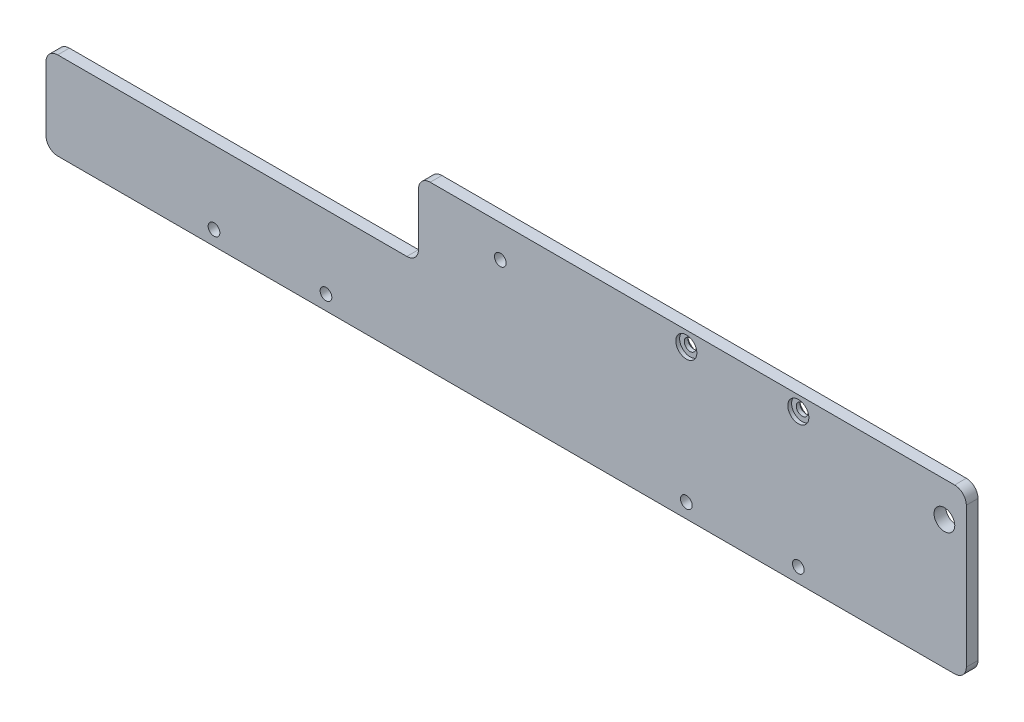
ISO-10303-21;
HEADER;
FILE_DESCRIPTION(('STEP AP214'),'2;1');
FILE_NAME('part.step','',(''),(''),'','','');
FILE_SCHEMA(('AUTOMOTIVE_DESIGN { 1 0 10303 214 1 1 1 1 }'));
ENDSEC;
DATA;
#1=APPLICATION_CONTEXT('core data for automotive mechanical design processes');
#2=APPLICATION_PROTOCOL_DEFINITION('international standard','automotive_design',2000,#1);
#3=PRODUCT_CONTEXT('',#1,'mechanical');
#4=PRODUCT('Part','Part','',(#3));
#5=PRODUCT_RELATED_PRODUCT_CATEGORY('part','',(#4));
#6=PRODUCT_DEFINITION_FORMATION('','',#4);
#7=PRODUCT_DEFINITION_CONTEXT('part definition',#1,'design');
#8=PRODUCT_DEFINITION('design','',#6,#7);
#9=PRODUCT_DEFINITION_SHAPE('','',#8);
#10=(LENGTH_UNIT() NAMED_UNIT(*) SI_UNIT(.MILLI.,.METRE.));
#11=(NAMED_UNIT(*) PLANE_ANGLE_UNIT() SI_UNIT($,.RADIAN.));
#12=(NAMED_UNIT(*) SI_UNIT($,.STERADIAN.) SOLID_ANGLE_UNIT());
#13=UNCERTAINTY_MEASURE_WITH_UNIT(LENGTH_MEASURE(1.E-05),#10,'distance_accuracy_value','');
#14=(GEOMETRIC_REPRESENTATION_CONTEXT(3) GLOBAL_UNCERTAINTY_ASSIGNED_CONTEXT((#13)) GLOBAL_UNIT_ASSIGNED_CONTEXT((#10,
#11,#12)) REPRESENTATION_CONTEXT('',''));
#15=CARTESIAN_POINT('',(0.,0.,0.));
#16=DIRECTION('',(0.,0.,1.));
#17=DIRECTION('',(1.,0.,0.));
#18=AXIS2_PLACEMENT_3D('',#15,#16,#17);
#19=CARTESIAN_POINT('',(34.4759372454945,38.5899107385244,4.));
#20=DIRECTION('',(0.,0.,-1.));
#21=DIRECTION('',(-1.,0.,0.));
#22=AXIS2_PLACEMENT_3D('',#19,#20,#21);
#23=CYLINDRICAL_SURFACE('',#22,1.99999999999999);
#24=CARTESIAN_POINT('',(34.4759372454945,38.5899107385244,1.4));
#25=DIRECTION('',(0.,0.,-1.));
#26=DIRECTION('',(-1.,0.,0.));
#27=AXIS2_PLACEMENT_3D('',#24,#25,#26);
#28=CIRCLE('',#27,1.99999999999999);
#29=CARTESIAN_POINT('',(32.4759372454945,38.5899107385244,1.4));
#30=VERTEX_POINT('',#29);
#31=EDGE_CURVE('E213',#30,#30,#28,.T.);
#32=ORIENTED_EDGE('',*,*,#31,.T.);
#33=EDGE_LOOP('',(#32));
#34=FACE_BOUND('',#33,.T.);
#35=CARTESIAN_POINT('',(34.4759372454945,38.5899107385244,2.7));
#36=DIRECTION('',(0.,0.,1.));
#37=DIRECTION('',(1.,0.,0.));
#38=AXIS2_PLACEMENT_3D('',#35,#36,#37);
#39=CIRCLE('',#38,1.99999999999999);
#40=CARTESIAN_POINT('',(36.4759372454945,38.5899107385244,2.7));
#41=VERTEX_POINT('',#40);
#42=EDGE_CURVE('E41',#41,#41,#39,.T.);
#43=ORIENTED_EDGE('',*,*,#42,.T.);
#44=EDGE_LOOP('',(#43));
#45=FACE_BOUND('',#44,.T.);
#46=ADVANCED_FACE('F37',(#34,#45),#23,.F.);
#47=CARTESIAN_POINT('',(72.8059372454945,38.5899107385243,4.));
#48=DIRECTION('',(0.,0.,-1.));
#49=DIRECTION('',(-1.,0.,0.));
#50=AXIS2_PLACEMENT_3D('',#47,#48,#49);
#51=CYLINDRICAL_SURFACE('',#50,2.);
#52=CARTESIAN_POINT('',(72.8059372454945,38.5899107385243,1.4));
#53=DIRECTION('',(0.,0.,-1.));
#54=DIRECTION('',(-1.,0.,0.));
#55=AXIS2_PLACEMENT_3D('',#52,#53,#54);
#56=CIRCLE('',#55,2.);
#57=CARTESIAN_POINT('',(70.8059372454945,38.5899107385243,1.4));
#58=VERTEX_POINT('',#57);
#59=EDGE_CURVE('E210',#58,#58,#56,.T.);
#60=ORIENTED_EDGE('',*,*,#59,.T.);
#61=EDGE_LOOP('',(#60));
#62=FACE_BOUND('',#61,.T.);
#63=CARTESIAN_POINT('',(72.8059372454945,38.5899107385243,2.7));
#64=DIRECTION('',(0.,0.,1.));
#65=DIRECTION('',(1.,0.,0.));
#66=AXIS2_PLACEMENT_3D('',#63,#64,#65);
#67=CIRCLE('',#66,2.);
#68=CARTESIAN_POINT('',(74.8059372454945,38.5899107385243,2.7));
#69=VERTEX_POINT('',#68);
#70=EDGE_CURVE('E217',#69,#69,#67,.T.);
#71=ORIENTED_EDGE('',*,*,#70,.T.);
#72=EDGE_LOOP('',(#71));
#73=FACE_BOUND('',#72,.T.);
#74=ADVANCED_FACE('F341',(#62,#73),#51,.F.);
#75=CARTESIAN_POINT('',(0.,17.5899107385243,4.));
#76=DIRECTION('',(0.,-1.,0.));
#77=DIRECTION('',(1.,0.,0.));
#78=AXIS2_PLACEMENT_3D('',#75,#76,#77);
#79=PLANE('',#78);
#80=DIRECTION('',(0.,0.,-1.));
#81=VECTOR('',#80,1.);
#82=CARTESIAN_POINT('',(-61.1940627545055,17.5899107385243,4.));
#83=LINE('',#82,#81);
#84=CARTESIAN_POINT('',(-61.1940627545055,17.5899107385243,4.));
#85=VERTEX_POINT('',#84);
#86=CARTESIAN_POINT('',(-61.1940627545055,17.5899107385243,0.));
#87=VERTEX_POINT('',#86);
#88=EDGE_CURVE('E264',#85,#87,#83,.T.);
#89=ORIENTED_EDGE('',*,*,#88,.T.);
#90=DIRECTION('',(-1.,0.,0.));
#91=VECTOR('',#90,1.);
#92=CARTESIAN_POINT('',(0.,17.5899107385243,0.));
#93=LINE('',#92,#91);
#94=CARTESIAN_POINT('',(-180.694062754505,17.5899107385243,0.));
#95=VERTEX_POINT('',#94);
#96=EDGE_CURVE('E164',#87,#95,#93,.T.);
#97=ORIENTED_EDGE('',*,*,#96,.T.);
#98=DIRECTION('',(0.,0.,-1.));
#99=VECTOR('',#98,1.);
#100=CARTESIAN_POINT('',(-180.694062754505,17.5899107385243,4.));
#101=LINE('',#100,#99);
#102=CARTESIAN_POINT('',(-180.694062754505,17.5899107385243,4.));
#103=VERTEX_POINT('',#102);
#104=EDGE_CURVE('E11',#103,#95,#101,.T.);
#105=ORIENTED_EDGE('',*,*,#104,.F.);
#106=DIRECTION('',(-1.,0.,0.));
#107=VECTOR('',#106,1.);
#108=CARTESIAN_POINT('',(0.,17.5899107385243,4.));
#109=LINE('',#108,#107);
#110=EDGE_CURVE('E54',#85,#103,#109,.T.);
#111=ORIENTED_EDGE('',*,*,#110,.F.);
#112=EDGE_LOOP('',(#89,#97,#105,#111));
#113=FACE_BOUND('',#112,.T.);
#114=ADVANCED_FACE('F39',(#113),#79,.F.);
#115=CARTESIAN_POINT('',(-180.694062754505,13.5899107385243,4.));
#116=DIRECTION('',(0.,0.,-1.));
#117=DIRECTION('',(-1.,0.,0.));
#118=AXIS2_PLACEMENT_3D('',#115,#116,#117);
#119=CYLINDRICAL_SURFACE('',#118,4.);
#120=CARTESIAN_POINT('',(-180.694062754505,13.5899107385243,0.));
#121=DIRECTION('',(0.,0.,1.));
#122=DIRECTION('',(1.,0.,0.));
#123=AXIS2_PLACEMENT_3D('',#120,#121,#122);
#124=CIRCLE('',#123,4.);
#125=CARTESIAN_POINT('',(-184.694062754505,13.5899107385243,0.));
#126=VERTEX_POINT('',#125);
#127=EDGE_CURVE('E166',#126,#95,#124,.F.);
#128=ORIENTED_EDGE('',*,*,#127,.F.);
#129=DIRECTION('',(0.,0.,-1.));
#130=VECTOR('',#129,1.);
#131=CARTESIAN_POINT('',(-184.694062754505,13.5899107385243,4.));
#132=LINE('',#131,#130);
#133=CARTESIAN_POINT('',(-184.694062754505,13.5899107385243,4.));
#134=VERTEX_POINT('',#133);
#135=EDGE_CURVE('E46',#134,#126,#132,.T.);
#136=ORIENTED_EDGE('',*,*,#135,.F.);
#137=CARTESIAN_POINT('',(-180.694062754505,13.5899107385243,4.));
#138=DIRECTION('',(0.,0.,1.));
#139=DIRECTION('',(1.,0.,0.));
#140=AXIS2_PLACEMENT_3D('',#137,#138,#139);
#141=CIRCLE('',#140,4.);
#142=EDGE_CURVE('E282',#134,#103,#141,.F.);
#143=ORIENTED_EDGE('',*,*,#142,.T.);
#144=ORIENTED_EDGE('',*,*,#104,.T.);
#145=EDGE_LOOP('',(#128,#136,#143,#144));
#146=FACE_BOUND('',#145,.T.);
#147=ADVANCED_FACE('F325',(#146),#119,.T.);
#148=CARTESIAN_POINT('',(-184.694062754505,0.,4.));
#149=DIRECTION('',(-1.,0.,0.));
#150=DIRECTION('',(0.,0.,1.));
#151=AXIS2_PLACEMENT_3D('',#148,#149,#150);
#152=PLANE('',#151);
#153=DIRECTION('',(0.,1.,0.));
#154=VECTOR('',#153,1.);
#155=CARTESIAN_POINT('',(-184.694062754505,0.,0.));
#156=LINE('',#155,#154);
#157=CARTESIAN_POINT('',(-184.694062754505,-8.41008926147568,0.));
#158=VERTEX_POINT('',#157);
#159=EDGE_CURVE('E170',#158,#126,#156,.T.);
#160=ORIENTED_EDGE('',*,*,#159,.F.);
#161=DIRECTION('',(0.,0.,-1.));
#162=VECTOR('',#161,1.);
#163=CARTESIAN_POINT('',(-184.694062754505,-8.41008926147568,4.));
#164=LINE('',#163,#162);
#165=CARTESIAN_POINT('',(-184.694062754505,-8.41008926147568,4.));
#166=VERTEX_POINT('',#165);
#167=EDGE_CURVE('E207',#166,#158,#164,.T.);
#168=ORIENTED_EDGE('',*,*,#167,.F.);
#169=DIRECTION('',(0.,1.,0.));
#170=VECTOR('',#169,1.);
#171=CARTESIAN_POINT('',(-184.694062754505,0.,4.));
#172=LINE('',#171,#170);
#173=EDGE_CURVE('E285',#166,#134,#172,.T.);
#174=ORIENTED_EDGE('',*,*,#173,.T.);
#175=ORIENTED_EDGE('',*,*,#135,.T.);
#176=EDGE_LOOP('',(#160,#168,#174,#175));
#177=FACE_BOUND('',#176,.T.);
#178=ADVANCED_FACE('F328',(#177),#152,.T.);
#179=CARTESIAN_POINT('',(-180.694062754505,-8.41008926147568,4.));
#180=DIRECTION('',(0.,0.,-1.));
#181=DIRECTION('',(-1.,0.,0.));
#182=AXIS2_PLACEMENT_3D('',#179,#180,#181);
#183=CYLINDRICAL_SURFACE('',#182,4.);
#184=CARTESIAN_POINT('',(-180.694062754505,-8.41008926147568,0.));
#185=DIRECTION('',(0.,0.,1.));
#186=DIRECTION('',(1.,0.,0.));
#187=AXIS2_PLACEMENT_3D('',#184,#185,#186);
#188=CIRCLE('',#187,4.);
#189=CARTESIAN_POINT('',(-180.694062754505,-12.4100892614757,0.));
#190=VERTEX_POINT('',#189);
#191=EDGE_CURVE('E173',#190,#158,#188,.F.);
#192=ORIENTED_EDGE('',*,*,#191,.F.);
#193=DIRECTION('',(0.,0.,-1.));
#194=VECTOR('',#193,1.);
#195=CARTESIAN_POINT('',(-180.694062754505,-12.4100892614757,4.));
#196=LINE('',#195,#194);
#197=CARTESIAN_POINT('',(-180.694062754505,-12.4100892614757,4.));
#198=VERTEX_POINT('',#197);
#199=EDGE_CURVE('E205',#198,#190,#196,.T.);
#200=ORIENTED_EDGE('',*,*,#199,.F.);
#201=CARTESIAN_POINT('',(-180.694062754505,-8.41008926147568,4.));
#202=DIRECTION('',(0.,0.,1.));
#203=DIRECTION('',(1.,0.,0.));
#204=AXIS2_PLACEMENT_3D('',#201,#202,#203);
#205=CIRCLE('',#204,4.);
#206=EDGE_CURVE('E288',#198,#166,#205,.F.);
#207=ORIENTED_EDGE('',*,*,#206,.T.);
#208=ORIENTED_EDGE('',*,*,#167,.T.);
#209=EDGE_LOOP('',(#192,#200,#207,#208));
#210=FACE_BOUND('',#209,.T.);
#211=ADVANCED_FACE('F331',(#210),#183,.T.);
#212=CARTESIAN_POINT('',(0.,-12.4100892614757,4.));
#213=DIRECTION('',(0.,-1.,0.));
#214=DIRECTION('',(1.,0.,0.));
#215=AXIS2_PLACEMENT_3D('',#212,#213,#214);
#216=PLANE('',#215);
#217=DIRECTION('',(-1.,0.,0.));
#218=VECTOR('',#217,1.);
#219=CARTESIAN_POINT('',(0.,-12.4100892614757,0.));
#220=LINE('',#219,#218);
#221=CARTESIAN_POINT('',(126.305937245495,-12.4100892614757,0.));
#222=VERTEX_POINT('',#221);
#223=EDGE_CURVE('E176',#222,#190,#220,.T.);
#224=ORIENTED_EDGE('',*,*,#223,.F.);
#225=DIRECTION('',(0.,0.,-1.));
#226=VECTOR('',#225,1.);
#227=CARTESIAN_POINT('',(126.305937245495,-12.4100892614757,4.));
#228=LINE('',#227,#226);
#229=CARTESIAN_POINT('',(126.305937245495,-12.4100892614757,4.));
#230=VERTEX_POINT('',#229);
#231=EDGE_CURVE('E138',#230,#222,#228,.T.);
#232=ORIENTED_EDGE('',*,*,#231,.F.);
#233=DIRECTION('',(-1.,0.,0.));
#234=VECTOR('',#233,1.);
#235=CARTESIAN_POINT('',(0.,-12.4100892614757,4.));
#236=LINE('',#235,#234);
#237=EDGE_CURVE('E128',#230,#198,#236,.T.);
#238=ORIENTED_EDGE('',*,*,#237,.T.);
#239=ORIENTED_EDGE('',*,*,#199,.T.);
#240=EDGE_LOOP('',(#224,#232,#238,#239));
#241=FACE_BOUND('',#240,.T.);
#242=ADVANCED_FACE('F292',(#241),#216,.T.);
#243=CARTESIAN_POINT('',(126.305937245495,-8.41008926147565,4.));
#244=DIRECTION('',(0.,0.,-1.));
#245=DIRECTION('',(-1.,0.,0.));
#246=AXIS2_PLACEMENT_3D('',#243,#244,#245);
#247=CYLINDRICAL_SURFACE('',#246,4.);
#248=CARTESIAN_POINT('',(126.305937245495,-8.41008926147565,0.));
#249=DIRECTION('',(0.,0.,1.));
#250=DIRECTION('',(1.,0.,0.));
#251=AXIS2_PLACEMENT_3D('',#248,#249,#250);
#252=CIRCLE('',#251,4.);
#253=CARTESIAN_POINT('',(130.305937245495,-8.41008926147565,0.));
#254=VERTEX_POINT('',#253);
#255=EDGE_CURVE('E135',#222,#254,#252,.T.);
#256=ORIENTED_EDGE('',*,*,#255,.T.);
#257=DIRECTION('',(0.,0.,-1.));
#258=VECTOR('',#257,1.);
#259=CARTESIAN_POINT('',(130.305937245495,-8.41008926147565,4.));
#260=LINE('',#259,#258);
#261=CARTESIAN_POINT('',(130.305937245495,-8.41008926147565,4.));
#262=VERTEX_POINT('',#261);
#263=EDGE_CURVE('E132',#262,#254,#260,.T.);
#264=ORIENTED_EDGE('',*,*,#263,.F.);
#265=CARTESIAN_POINT('',(126.305937245495,-8.41008926147565,4.));
#266=DIRECTION('',(0.,0.,1.));
#267=DIRECTION('',(1.,0.,0.));
#268=AXIS2_PLACEMENT_3D('',#265,#266,#267);
#269=CIRCLE('',#268,4.);
#270=EDGE_CURVE('E119',#230,#262,#269,.T.);
#271=ORIENTED_EDGE('',*,*,#270,.F.);
#272=ORIENTED_EDGE('',*,*,#231,.T.);
#273=EDGE_LOOP('',(#256,#264,#271,#272));
#274=FACE_BOUND('',#273,.T.);
#275=ADVANCED_FACE('F133',(#274),#247,.T.);
#276=CARTESIAN_POINT('',(130.305937245495,0.,4.));
#277=DIRECTION('',(-1.,0.,0.));
#278=DIRECTION('',(0.,0.,1.));
#279=AXIS2_PLACEMENT_3D('',#276,#277,#278);
#280=PLANE('',#279);
#281=DIRECTION('',(0.,1.,0.));
#282=VECTOR('',#281,1.);
#283=CARTESIAN_POINT('',(130.305937245495,0.,0.));
#284=LINE('',#283,#282);
#285=CARTESIAN_POINT('',(130.305937245495,39.5899107385243,0.));
#286=VERTEX_POINT('',#285);
#287=EDGE_CURVE('E180',#254,#286,#284,.T.);
#288=ORIENTED_EDGE('',*,*,#287,.T.);
#289=DIRECTION('',(0.,0.,-1.));
#290=VECTOR('',#289,1.);
#291=CARTESIAN_POINT('',(130.305937245495,39.5899107385243,4.));
#292=LINE('',#291,#290);
#293=CARTESIAN_POINT('',(130.305937245495,39.5899107385243,4.));
#294=VERTEX_POINT('',#293);
#295=EDGE_CURVE('E139',#294,#286,#292,.T.);
#296=ORIENTED_EDGE('',*,*,#295,.F.);
#297=DIRECTION('',(0.,1.,0.));
#298=VECTOR('',#297,1.);
#299=CARTESIAN_POINT('',(130.305937245495,0.,4.));
#300=LINE('',#299,#298);
#301=EDGE_CURVE('E124',#262,#294,#300,.T.);
#302=ORIENTED_EDGE('',*,*,#301,.F.);
#303=ORIENTED_EDGE('',*,*,#263,.T.);
#304=EDGE_LOOP('',(#288,#296,#302,#303));
#305=FACE_BOUND('',#304,.T.);
#306=ADVANCED_FACE('F141',(#305),#280,.F.);
#307=CARTESIAN_POINT('',(126.305937245495,39.5899107385243,4.));
#308=DIRECTION('',(0.,0.,-1.));
#309=DIRECTION('',(-1.,0.,0.));
#310=AXIS2_PLACEMENT_3D('',#307,#308,#309);
#311=CYLINDRICAL_SURFACE('',#310,4.);
#312=CARTESIAN_POINT('',(126.305937245495,39.5899107385243,0.));
#313=DIRECTION('',(0.,0.,1.));
#314=DIRECTION('',(1.,0.,0.));
#315=AXIS2_PLACEMENT_3D('',#312,#313,#314);
#316=CIRCLE('',#315,4.);
#317=CARTESIAN_POINT('',(126.305937245495,43.5899107385243,0.));
#318=VERTEX_POINT('',#317);
#319=EDGE_CURVE('E182',#286,#318,#316,.T.);
#320=ORIENTED_EDGE('',*,*,#319,.T.);
#321=DIRECTION('',(0.,0.,-1.));
#322=VECTOR('',#321,1.);
#323=CARTESIAN_POINT('',(126.305937245495,43.5899107385243,4.));
#324=LINE('',#323,#322);
#325=CARTESIAN_POINT('',(126.305937245495,43.5899107385243,4.));
#326=VERTEX_POINT('',#325);
#327=EDGE_CURVE('E96',#326,#318,#324,.T.);
#328=ORIENTED_EDGE('',*,*,#327,.F.);
#329=CARTESIAN_POINT('',(126.305937245495,39.5899107385243,4.));
#330=DIRECTION('',(0.,0.,1.));
#331=DIRECTION('',(1.,0.,0.));
#332=AXIS2_PLACEMENT_3D('',#329,#330,#331);
#333=CIRCLE('',#332,4.);
#334=EDGE_CURVE('E63',#294,#326,#333,.T.);
#335=ORIENTED_EDGE('',*,*,#334,.F.);
#336=ORIENTED_EDGE('',*,*,#295,.T.);
#337=EDGE_LOOP('',(#320,#328,#335,#336));
#338=FACE_BOUND('',#337,.T.);
#339=ADVANCED_FACE('F299',(#338),#311,.T.);
#340=CARTESIAN_POINT('',(0.,43.5899107385243,4.));
#341=DIRECTION('',(0.,1.,0.));
#342=DIRECTION('',(-1.,0.,0.));
#343=AXIS2_PLACEMENT_3D('',#340,#341,#342);
#344=PLANE('',#343);
#345=DIRECTION('',(1.,0.,0.));
#346=VECTOR('',#345,1.);
#347=CARTESIAN_POINT('',(0.,43.5899107385243,0.));
#348=LINE('',#347,#346);
#349=CARTESIAN_POINT('',(-53.1940627545055,43.5899107385243,0.));
#350=VERTEX_POINT('',#349);
#351=EDGE_CURVE('E184',#350,#318,#348,.T.);
#352=ORIENTED_EDGE('',*,*,#351,.F.);
#353=DIRECTION('',(0.,0.,-1.));
#354=VECTOR('',#353,1.);
#355=CARTESIAN_POINT('',(-53.1940627545055,43.5899107385243,4.));
#356=LINE('',#355,#354);
#357=CARTESIAN_POINT('',(-53.1940627545055,43.5899107385243,4.));
#358=VERTEX_POINT('',#357);
#359=EDGE_CURVE('E167',#358,#350,#356,.T.);
#360=ORIENTED_EDGE('',*,*,#359,.F.);
#361=DIRECTION('',(1.,0.,0.));
#362=VECTOR('',#361,1.);
#363=CARTESIAN_POINT('',(0.,43.5899107385243,4.));
#364=LINE('',#363,#362);
#365=EDGE_CURVE('E144',#358,#326,#364,.T.);
#366=ORIENTED_EDGE('',*,*,#365,.T.);
#367=ORIENTED_EDGE('',*,*,#327,.T.);
#368=EDGE_LOOP('',(#352,#360,#366,#367));
#369=FACE_BOUND('',#368,.T.);
#370=ADVANCED_FACE('F301',(#369),#344,.T.);
#371=CARTESIAN_POINT('',(-127.194062754505,-7.41008926147568,4.));
#372=DIRECTION('',(0.,0.,-1.));
#373=DIRECTION('',(-1.,0.,0.));
#374=AXIS2_PLACEMENT_3D('',#371,#372,#373);
#375=CYLINDRICAL_SURFACE('',#374,2.);
#376=CARTESIAN_POINT('',(-127.194062754505,-7.41008926147568,4.));
#377=DIRECTION('',(0.,0.,1.));
#378=DIRECTION('',(1.,0.,0.));
#379=AXIS2_PLACEMENT_3D('',#376,#377,#378);
#380=CIRCLE('',#379,2.);
#381=CARTESIAN_POINT('',(-125.194062754505,-7.41008926147568,4.));
#382=VERTEX_POINT('',#381);
#383=EDGE_CURVE('E158',#382,#382,#380,.T.);
#384=ORIENTED_EDGE('',*,*,#383,.T.);
#385=EDGE_LOOP('',(#384));
#386=FACE_BOUND('',#385,.T.);
#387=CARTESIAN_POINT('',(-127.194062754505,-7.41008926147568,0.));
#388=DIRECTION('',(0.,0.,1.));
#389=DIRECTION('',(1.,0.,0.));
#390=AXIS2_PLACEMENT_3D('',#387,#388,#389);
#391=CIRCLE('',#390,2.);
#392=CARTESIAN_POINT('',(-125.194062754505,-7.41008926147568,0.));
#393=VERTEX_POINT('',#392);
#394=EDGE_CURVE('E196',#393,#393,#391,.T.);
#395=ORIENTED_EDGE('',*,*,#394,.F.);
#396=EDGE_LOOP('',(#395));
#397=FACE_BOUND('',#396,.T.);
#398=ADVANCED_FACE('F362',(#386,#397),#375,.F.);
#399=CARTESIAN_POINT('',(-88.8640627545055,-7.41008926147558,4.));
#400=DIRECTION('',(0.,0.,-1.));
#401=DIRECTION('',(-1.,0.,0.));
#402=AXIS2_PLACEMENT_3D('',#399,#400,#401);
#403=CYLINDRICAL_SURFACE('',#402,2.);
#404=CARTESIAN_POINT('',(-88.8640627545055,-7.41008926147558,4.));
#405=DIRECTION('',(0.,0.,1.));
#406=DIRECTION('',(1.,0.,0.));
#407=AXIS2_PLACEMENT_3D('',#404,#405,#406);
#408=CIRCLE('',#407,2.);
#409=CARTESIAN_POINT('',(-86.8640627545055,-7.41008926147558,4.));
#410=VERTEX_POINT('',#409);
#411=EDGE_CURVE('E155',#410,#410,#408,.T.);
#412=ORIENTED_EDGE('',*,*,#411,.T.);
#413=EDGE_LOOP('',(#412));
#414=FACE_BOUND('',#413,.T.);
#415=CARTESIAN_POINT('',(-88.8640627545055,-7.41008926147558,0.));
#416=DIRECTION('',(0.,0.,1.));
#417=DIRECTION('',(1.,0.,0.));
#418=AXIS2_PLACEMENT_3D('',#415,#416,#417);
#419=CIRCLE('',#418,2.);
#420=CARTESIAN_POINT('',(-86.8640627545055,-7.41008926147558,0.));
#421=VERTEX_POINT('',#420);
#422=EDGE_CURVE('E193',#421,#421,#419,.T.);
#423=ORIENTED_EDGE('',*,*,#422,.F.);
#424=EDGE_LOOP('',(#423));
#425=FACE_BOUND('',#424,.T.);
#426=ADVANCED_FACE('F392',(#414,#425),#403,.F.);
#427=CARTESIAN_POINT('',(34.4759372454946,-7.41008926147557,4.));
#428=DIRECTION('',(0.,0.,-1.));
#429=DIRECTION('',(-1.,0.,0.));
#430=AXIS2_PLACEMENT_3D('',#427,#428,#429);
#431=CYLINDRICAL_SURFACE('',#430,2.);
#432=CARTESIAN_POINT('',(34.4759372454946,-7.41008926147557,4.));
#433=DIRECTION('',(0.,0.,1.));
#434=DIRECTION('',(1.,0.,0.));
#435=AXIS2_PLACEMENT_3D('',#432,#433,#434);
#436=CIRCLE('',#435,2.);
#437=CARTESIAN_POINT('',(36.4759372454946,-7.41008926147557,4.));
#438=VERTEX_POINT('',#437);
#439=EDGE_CURVE('E152',#438,#438,#436,.F.);
#440=ORIENTED_EDGE('',*,*,#439,.F.);
#441=EDGE_LOOP('',(#440));
#442=FACE_BOUND('',#441,.T.);
#443=CARTESIAN_POINT('',(34.4759372454946,-7.41008926147557,0.));
#444=DIRECTION('',(0.,0.,1.));
#445=DIRECTION('',(1.,0.,0.));
#446=AXIS2_PLACEMENT_3D('',#443,#444,#445);
#447=CIRCLE('',#446,2.);
#448=CARTESIAN_POINT('',(36.4759372454946,-7.41008926147557,0.));
#449=VERTEX_POINT('',#448);
#450=EDGE_CURVE('E190',#449,#449,#447,.F.);
#451=ORIENTED_EDGE('',*,*,#450,.T.);
#452=EDGE_LOOP('',(#451));
#453=FACE_BOUND('',#452,.T.);
#454=ADVANCED_FACE('F352',(#442,#453),#431,.F.);
#455=CARTESIAN_POINT('',(122.805937245495,31.5899107385243,4.));
#456=DIRECTION('',(0.,0.,-1.));
#457=DIRECTION('',(-1.,0.,0.));
#458=AXIS2_PLACEMENT_3D('',#455,#456,#457);
#459=CYLINDRICAL_SURFACE('',#458,3.54999999999999);
#460=CARTESIAN_POINT('',(122.805937245495,31.5899107385243,4.));
#461=DIRECTION('',(0.,0.,1.));
#462=DIRECTION('',(1.,0.,0.));
#463=AXIS2_PLACEMENT_3D('',#460,#461,#462);
#464=CIRCLE('',#463,3.54999999999999);
#465=CARTESIAN_POINT('',(126.355937245495,31.5899107385243,4.));
#466=VERTEX_POINT('',#465);
#467=EDGE_CURVE('E149',#466,#466,#464,.T.);
#468=ORIENTED_EDGE('',*,*,#467,.T.);
#469=EDGE_LOOP('',(#468));
#470=FACE_BOUND('',#469,.T.);
#471=CARTESIAN_POINT('',(122.805937245495,31.5899107385243,0.));
#472=DIRECTION('',(0.,0.,1.));
#473=DIRECTION('',(1.,0.,0.));
#474=AXIS2_PLACEMENT_3D('',#471,#472,#473);
#475=CIRCLE('',#474,3.54999999999999);
#476=CARTESIAN_POINT('',(126.355937245495,31.5899107385243,0.));
#477=VERTEX_POINT('',#476);
#478=EDGE_CURVE('E187',#477,#477,#475,.T.);
#479=ORIENTED_EDGE('',*,*,#478,.F.);
#480=EDGE_LOOP('',(#479));
#481=FACE_BOUND('',#480,.T.);
#482=ADVANCED_FACE('F355',(#470,#481),#459,.F.);
#483=CARTESIAN_POINT('',(72.8059372454946,-7.41008926147566,4.));
#484=DIRECTION('',(0.,0.,-1.));
#485=DIRECTION('',(-1.,0.,0.));
#486=AXIS2_PLACEMENT_3D('',#483,#484,#485);
#487=CYLINDRICAL_SURFACE('',#486,2.00000000000001);
#488=CARTESIAN_POINT('',(72.8059372454946,-7.41008926147566,4.));
#489=DIRECTION('',(0.,0.,1.));
#490=DIRECTION('',(1.,0.,0.));
#491=AXIS2_PLACEMENT_3D('',#488,#489,#490);
#492=CIRCLE('',#491,2.00000000000001);
#493=CARTESIAN_POINT('',(74.8059372454946,-7.41008926147566,4.));
#494=VERTEX_POINT('',#493);
#495=EDGE_CURVE('E161',#494,#494,#492,.F.);
#496=ORIENTED_EDGE('',*,*,#495,.F.);
#497=EDGE_LOOP('',(#496));
#498=FACE_BOUND('',#497,.T.);
#499=CARTESIAN_POINT('',(72.8059372454946,-7.41008926147566,0.));
#500=DIRECTION('',(0.,0.,1.));
#501=DIRECTION('',(1.,0.,0.));
#502=AXIS2_PLACEMENT_3D('',#499,#500,#501);
#503=CIRCLE('',#502,2.00000000000001);
#504=CARTESIAN_POINT('',(74.8059372454946,-7.41008926147566,0.));
#505=VERTEX_POINT('',#504);
#506=EDGE_CURVE('E199',#505,#505,#503,.F.);
#507=ORIENTED_EDGE('',*,*,#506,.T.);
#508=EDGE_LOOP('',(#507));
#509=FACE_BOUND('',#508,.T.);
#510=ADVANCED_FACE('F358',(#498,#509),#487,.F.);
#511=CARTESIAN_POINT('',(0.,0.,4.));
#512=DIRECTION('',(0.,0.,1.));
#513=DIRECTION('',(1.,0.,0.));
#514=AXIS2_PLACEMENT_3D('',#511,#512,#513);
#515=PLANE('',#514);
#516=CARTESIAN_POINT('',(72.8059372454945,38.5899107385243,4.));
#517=DIRECTION('',(0.,0.,1.));
#518=DIRECTION('',(1.,0.,0.));
#519=AXIS2_PLACEMENT_3D('',#516,#517,#518);
#520=CIRCLE('',#519,3.6);
#521=CARTESIAN_POINT('',(76.4059372454945,38.5899107385243,4.));
#522=VERTEX_POINT('',#521);
#523=EDGE_CURVE('E225',#522,#522,#520,.T.);
#524=ORIENTED_EDGE('',*,*,#523,.F.);
#525=EDGE_LOOP('',(#524));
#526=FACE_BOUND('',#525,.T.);
#527=CARTESIAN_POINT('',(34.4759372454945,38.5899107385244,4.));
#528=DIRECTION('',(0.,0.,1.));
#529=DIRECTION('',(1.,0.,0.));
#530=AXIS2_PLACEMENT_3D('',#527,#528,#529);
#531=CIRCLE('',#530,3.6);
#532=CARTESIAN_POINT('',(38.0759372454945,38.5899107385244,4.));
#533=VERTEX_POINT('',#532);
#534=EDGE_CURVE('E235',#533,#533,#531,.T.);
#535=ORIENTED_EDGE('',*,*,#534,.F.);
#536=EDGE_LOOP('',(#535));
#537=FACE_BOUND('',#536,.T.);
#538=CARTESIAN_POINT('',(-29.1940627545055,32.5899107385243,4.));
#539=DIRECTION('',(0.,0.,1.));
#540=DIRECTION('',(1.,0.,0.));
#541=AXIS2_PLACEMENT_3D('',#538,#539,#540);
#542=CIRCLE('',#541,2.00000000000001);
#543=CARTESIAN_POINT('',(-27.1940627545055,32.5899107385243,4.));
#544=VERTEX_POINT('',#543);
#545=EDGE_CURVE('E240',#544,#544,#542,.T.);
#546=ORIENTED_EDGE('',*,*,#545,.F.);
#547=EDGE_LOOP('',(#546));
#548=FACE_BOUND('',#547,.T.);
#549=ORIENTED_EDGE('',*,*,#365,.F.);
#550=CARTESIAN_POINT('',(-53.1940627545055,39.5899107385243,4.));
#551=DIRECTION('',(0.,0.,-1.));
#552=DIRECTION('',(-1.,0.,0.));
#553=AXIS2_PLACEMENT_3D('',#550,#551,#552);
#554=CIRCLE('',#553,4.);
#555=CARTESIAN_POINT('',(-57.1940627545055,39.5899107385243,4.));
#556=VERTEX_POINT('',#555);
#557=EDGE_CURVE('E261',#556,#358,#554,.T.);
#558=ORIENTED_EDGE('',*,*,#557,.F.);
#559=DIRECTION('',(0.,-1.,0.));
#560=VECTOR('',#559,1.);
#561=CARTESIAN_POINT('',(-57.1940627545055,0.,4.));
#562=LINE('',#561,#560);
#563=CARTESIAN_POINT('',(-57.1940627545055,21.5899107385243,4.));
#564=VERTEX_POINT('',#563);
#565=EDGE_CURVE('E257',#556,#564,#562,.T.);
#566=ORIENTED_EDGE('',*,*,#565,.T.);
#567=CARTESIAN_POINT('',(-61.1940627545055,21.5899107385243,4.));
#568=DIRECTION('',(0.,0.,-1.));
#569=DIRECTION('',(-1.,0.,0.));
#570=AXIS2_PLACEMENT_3D('',#567,#568,#569);
#571=CIRCLE('',#570,4.00000000000001);
#572=EDGE_CURVE('E254',#85,#564,#571,.F.);
#573=ORIENTED_EDGE('',*,*,#572,.F.);
#574=ORIENTED_EDGE('',*,*,#110,.T.);
#575=ORIENTED_EDGE('',*,*,#142,.F.);
#576=ORIENTED_EDGE('',*,*,#173,.F.);
#577=ORIENTED_EDGE('',*,*,#206,.F.);
#578=ORIENTED_EDGE('',*,*,#237,.F.);
#579=ORIENTED_EDGE('',*,*,#270,.T.);
#580=ORIENTED_EDGE('',*,*,#301,.T.);
#581=ORIENTED_EDGE('',*,*,#334,.T.);
#582=EDGE_LOOP('',(#549,#558,#566,#573,#574,#575,#576,#577,#578,#579,#580,#581));
#583=FACE_BOUND('',#582,.T.);
#584=ORIENTED_EDGE('',*,*,#467,.F.);
#585=EDGE_LOOP('',(#584));
#586=FACE_BOUND('',#585,.T.);
#587=ORIENTED_EDGE('',*,*,#439,.T.);
#588=EDGE_LOOP('',(#587));
#589=FACE_BOUND('',#588,.T.);
#590=ORIENTED_EDGE('',*,*,#411,.F.);
#591=EDGE_LOOP('',(#590));
#592=FACE_BOUND('',#591,.T.);
#593=ORIENTED_EDGE('',*,*,#383,.F.);
#594=EDGE_LOOP('',(#593));
#595=FACE_BOUND('',#594,.T.);
#596=ORIENTED_EDGE('',*,*,#495,.T.);
#597=EDGE_LOOP('',(#596));
#598=FACE_BOUND('',#597,.T.);
#599=ADVANCED_FACE('F121',(#526,#537,#548,#583,#586,#589,#592,#595,#598),#515,.T.);
#600=CARTESIAN_POINT('',(0.,0.,0.));
#601=DIRECTION('',(0.,0.,1.));
#602=DIRECTION('',(1.,0.,0.));
#603=AXIS2_PLACEMENT_3D('',#600,#601,#602);
#604=PLANE('',#603);
#605=CARTESIAN_POINT('',(-29.1940627545055,32.5899107385243,0.));
#606=DIRECTION('',(0.,0.,-1.));
#607=DIRECTION('',(-1.,0.,0.));
#608=AXIS2_PLACEMENT_3D('',#605,#606,#607);
#609=CIRCLE('',#608,2.00000000000001);
#610=CARTESIAN_POINT('',(-31.1940627545055,32.5899107385243,0.));
#611=VERTEX_POINT('',#610);
#612=EDGE_CURVE('E223',#611,#611,#609,.T.);
#613=ORIENTED_EDGE('',*,*,#612,.F.);
#614=EDGE_LOOP('',(#613));
#615=FACE_BOUND('',#614,.T.);
#616=CARTESIAN_POINT('',(72.8059372454945,38.5899107385243,0.));
#617=DIRECTION('',(0.,0.,-1.));
#618=DIRECTION('',(-1.,0.,0.));
#619=AXIS2_PLACEMENT_3D('',#616,#617,#618);
#620=CIRCLE('',#619,3.6);
#621=CARTESIAN_POINT('',(69.2059372454945,38.5899107385243,0.));
#622=VERTEX_POINT('',#621);
#623=EDGE_CURVE('E246',#622,#622,#620,.T.);
#624=ORIENTED_EDGE('',*,*,#623,.F.);
#625=EDGE_LOOP('',(#624));
#626=FACE_BOUND('',#625,.T.);
#627=CARTESIAN_POINT('',(34.4759372454945,38.5899107385244,0.));
#628=DIRECTION('',(0.,0.,-1.));
#629=DIRECTION('',(-1.,0.,0.));
#630=AXIS2_PLACEMENT_3D('',#627,#628,#629);
#631=CIRCLE('',#630,3.6);
#632=CARTESIAN_POINT('',(30.8759372454945,38.5899107385244,0.));
#633=VERTEX_POINT('',#632);
#634=EDGE_CURVE('E243',#633,#633,#631,.T.);
#635=ORIENTED_EDGE('',*,*,#634,.F.);
#636=EDGE_LOOP('',(#635));
#637=FACE_BOUND('',#636,.T.);
#638=CARTESIAN_POINT('',(-53.1940627545055,39.5899107385243,0.));
#639=DIRECTION('',(0.,0.,-1.));
#640=DIRECTION('',(-1.,0.,0.));
#641=AXIS2_PLACEMENT_3D('',#638,#639,#640);
#642=CIRCLE('',#641,4.);
#643=CARTESIAN_POINT('',(-57.1940627545055,39.5899107385243,0.));
#644=VERTEX_POINT('',#643);
#645=EDGE_CURVE('E258',#644,#350,#642,.T.);
#646=ORIENTED_EDGE('',*,*,#645,.T.);
#647=ORIENTED_EDGE('',*,*,#351,.T.);
#648=ORIENTED_EDGE('',*,*,#319,.F.);
#649=ORIENTED_EDGE('',*,*,#287,.F.);
#650=ORIENTED_EDGE('',*,*,#255,.F.);
#651=ORIENTED_EDGE('',*,*,#223,.T.);
#652=ORIENTED_EDGE('',*,*,#191,.T.);
#653=ORIENTED_EDGE('',*,*,#159,.T.);
#654=ORIENTED_EDGE('',*,*,#127,.T.);
#655=ORIENTED_EDGE('',*,*,#96,.F.);
#656=CARTESIAN_POINT('',(-61.1940627545055,21.5899107385243,0.));
#657=DIRECTION('',(0.,0.,-1.));
#658=DIRECTION('',(-1.,0.,0.));
#659=AXIS2_PLACEMENT_3D('',#656,#657,#658);
#660=CIRCLE('',#659,4.00000000000001);
#661=CARTESIAN_POINT('',(-57.1940627545055,21.5899107385243,0.));
#662=VERTEX_POINT('',#661);
#663=EDGE_CURVE('E216',#87,#662,#660,.F.);
#664=ORIENTED_EDGE('',*,*,#663,.T.);
#665=DIRECTION('',(0.,-1.,0.));
#666=VECTOR('',#665,1.);
#667=CARTESIAN_POINT('',(-57.1940627545055,0.,0.));
#668=LINE('',#667,#666);
#669=EDGE_CURVE('E267',#644,#662,#668,.T.);
#670=ORIENTED_EDGE('',*,*,#669,.F.);
#671=EDGE_LOOP('',(#646,#647,#648,#649,#650,#651,#652,#653,#654,#655,#664,#670));
#672=FACE_BOUND('',#671,.T.);
#673=ORIENTED_EDGE('',*,*,#506,.F.);
#674=EDGE_LOOP('',(#673));
#675=FACE_BOUND('',#674,.T.);
#676=ORIENTED_EDGE('',*,*,#394,.T.);
#677=EDGE_LOOP('',(#676));
#678=FACE_BOUND('',#677,.T.);
#679=ORIENTED_EDGE('',*,*,#422,.T.);
#680=EDGE_LOOP('',(#679));
#681=FACE_BOUND('',#680,.T.);
#682=ORIENTED_EDGE('',*,*,#450,.F.);
#683=EDGE_LOOP('',(#682));
#684=FACE_BOUND('',#683,.T.);
#685=ORIENTED_EDGE('',*,*,#478,.T.);
#686=EDGE_LOOP('',(#685));
#687=FACE_BOUND('',#686,.T.);
#688=ADVANCED_FACE('F295',(#615,#626,#637,#672,#675,#678,#681,#684,#687),#604,.F.);
#689=CARTESIAN_POINT('',(-53.1940627545055,39.5899107385243,4.));
#690=DIRECTION('',(0.,0.,-1.));
#691=DIRECTION('',(-1.,0.,0.));
#692=AXIS2_PLACEMENT_3D('',#689,#690,#691);
#693=CYLINDRICAL_SURFACE('',#692,4.);
#694=ORIENTED_EDGE('',*,*,#645,.F.);
#695=DIRECTION('',(0.,0.,-1.));
#696=VECTOR('',#695,1.);
#697=CARTESIAN_POINT('',(-57.1940627545055,39.5899107385243,4.));
#698=LINE('',#697,#696);
#699=EDGE_CURVE('E274',#556,#644,#698,.T.);
#700=ORIENTED_EDGE('',*,*,#699,.F.);
#701=ORIENTED_EDGE('',*,*,#557,.T.);
#702=ORIENTED_EDGE('',*,*,#359,.T.);
#703=EDGE_LOOP('',(#694,#700,#701,#702));
#704=FACE_BOUND('',#703,.T.);
#705=ADVANCED_FACE('F435',(#704),#693,.T.);
#706=CARTESIAN_POINT('',(-57.1940627545055,0.,4.));
#707=DIRECTION('',(1.,0.,0.));
#708=DIRECTION('',(0.,1.,0.));
#709=AXIS2_PLACEMENT_3D('',#706,#707,#708);
#710=PLANE('',#709);
#711=ORIENTED_EDGE('',*,*,#669,.T.);
#712=DIRECTION('',(0.,0.,-1.));
#713=VECTOR('',#712,1.);
#714=CARTESIAN_POINT('',(-57.1940627545055,21.5899107385243,4.));
#715=LINE('',#714,#713);
#716=EDGE_CURVE('E277',#564,#662,#715,.T.);
#717=ORIENTED_EDGE('',*,*,#716,.F.);
#718=ORIENTED_EDGE('',*,*,#565,.F.);
#719=ORIENTED_EDGE('',*,*,#699,.T.);
#720=EDGE_LOOP('',(#711,#717,#718,#719));
#721=FACE_BOUND('',#720,.T.);
#722=ADVANCED_FACE('F319',(#721),#710,.F.);
#723=CARTESIAN_POINT('',(-61.1940627545055,21.5899107385243,4.));
#724=DIRECTION('',(0.,0.,-1.));
#725=DIRECTION('',(-1.,0.,0.));
#726=AXIS2_PLACEMENT_3D('',#723,#724,#725);
#727=CYLINDRICAL_SURFACE('',#726,4.00000000000001);
#728=ORIENTED_EDGE('',*,*,#663,.F.);
#729=ORIENTED_EDGE('',*,*,#88,.F.);
#730=ORIENTED_EDGE('',*,*,#572,.T.);
#731=ORIENTED_EDGE('',*,*,#716,.T.);
#732=EDGE_LOOP('',(#728,#729,#730,#731));
#733=FACE_BOUND('',#732,.T.);
#734=ADVANCED_FACE('F322',(#733),#727,.F.);
#735=CARTESIAN_POINT('',(34.4759372454945,38.5899107385244,1.4));
#736=DIRECTION('',(0.,0.,-1.));
#737=DIRECTION('',(-1.,0.,0.));
#738=AXIS2_PLACEMENT_3D('',#735,#736,#737);
#739=CYLINDRICAL_SURFACE('',#738,3.6);
#740=CARTESIAN_POINT('',(34.4759372454945,38.5899107385244,1.4));
#741=DIRECTION('',(0.,0.,-1.));
#742=DIRECTION('',(-1.,0.,0.));
#743=AXIS2_PLACEMENT_3D('',#740,#741,#742);
#744=CIRCLE('',#743,3.6);
#745=CARTESIAN_POINT('',(30.8759372454945,38.5899107385244,1.4));
#746=VERTEX_POINT('',#745);
#747=EDGE_CURVE('E249',#746,#746,#744,.T.);
#748=ORIENTED_EDGE('',*,*,#747,.F.);
#749=EDGE_LOOP('',(#748));
#750=FACE_BOUND('',#749,.T.);
#751=ORIENTED_EDGE('',*,*,#634,.T.);
#752=EDGE_LOOP('',(#751));
#753=FACE_BOUND('',#752,.T.);
#754=ADVANCED_FACE('F456',(#750,#753),#739,.F.);
#755=CARTESIAN_POINT('',(34.4759372454945,38.5899107385244,1.4));
#756=DIRECTION('',(0.,0.,-1.));
#757=DIRECTION('',(-1.,0.,0.));
#758=AXIS2_PLACEMENT_3D('',#755,#756,#757);
#759=PLANE('',#758);
#760=ORIENTED_EDGE('',*,*,#31,.F.);
#761=EDGE_LOOP('',(#760));
#762=FACE_BOUND('',#761,.T.);
#763=ORIENTED_EDGE('',*,*,#747,.T.);
#764=EDGE_LOOP('',(#763));
#765=FACE_BOUND('',#764,.T.);
#766=ADVANCED_FACE('F463',(#762,#765),#759,.T.);
#767=CARTESIAN_POINT('',(72.8059372454945,38.5899107385243,1.4));
#768=DIRECTION('',(0.,0.,-1.));
#769=DIRECTION('',(-1.,0.,0.));
#770=AXIS2_PLACEMENT_3D('',#767,#768,#769);
#771=CYLINDRICAL_SURFACE('',#770,3.6);
#772=CARTESIAN_POINT('',(72.8059372454945,38.5899107385243,1.4));
#773=DIRECTION('',(0.,0.,-1.));
#774=DIRECTION('',(-1.,0.,0.));
#775=AXIS2_PLACEMENT_3D('',#772,#773,#774);
#776=CIRCLE('',#775,3.6);
#777=CARTESIAN_POINT('',(69.2059372454945,38.5899107385243,1.4));
#778=VERTEX_POINT('',#777);
#779=EDGE_CURVE('E214',#778,#778,#776,.T.);
#780=ORIENTED_EDGE('',*,*,#779,.F.);
#781=EDGE_LOOP('',(#780));
#782=FACE_BOUND('',#781,.T.);
#783=ORIENTED_EDGE('',*,*,#623,.T.);
#784=EDGE_LOOP('',(#783));
#785=FACE_BOUND('',#784,.T.);
#786=ADVANCED_FACE('F471',(#782,#785),#771,.F.);
#787=CARTESIAN_POINT('',(72.8059372454945,38.5899107385243,1.4));
#788=DIRECTION('',(0.,0.,-1.));
#789=DIRECTION('',(-1.,0.,0.));
#790=AXIS2_PLACEMENT_3D('',#787,#788,#789);
#791=PLANE('',#790);
#792=ORIENTED_EDGE('',*,*,#59,.F.);
#793=EDGE_LOOP('',(#792));
#794=FACE_BOUND('',#793,.T.);
#795=ORIENTED_EDGE('',*,*,#779,.T.);
#796=EDGE_LOOP('',(#795));
#797=FACE_BOUND('',#796,.T.);
#798=ADVANCED_FACE('F479',(#794,#797),#791,.T.);
#799=CARTESIAN_POINT('',(-29.1940627545055,32.5899107385243,10.));
#800=DIRECTION('',(0.,0.,-1.));
#801=DIRECTION('',(-1.,0.,0.));
#802=AXIS2_PLACEMENT_3D('',#799,#800,#801);
#803=CYLINDRICAL_SURFACE('',#802,2.00000000000001);
#804=ORIENTED_EDGE('',*,*,#545,.T.);
#805=EDGE_LOOP('',(#804));
#806=FACE_BOUND('',#805,.T.);
#807=ORIENTED_EDGE('',*,*,#612,.T.);
#808=EDGE_LOOP('',(#807));
#809=FACE_BOUND('',#808,.T.);
#810=ADVANCED_FACE('F486',(#806,#809),#803,.F.);
#811=CARTESIAN_POINT('',(34.4759372454945,38.5899107385244,2.7));
#812=DIRECTION('',(0.,0.,1.));
#813=DIRECTION('',(1.,0.,0.));
#814=AXIS2_PLACEMENT_3D('',#811,#812,#813);
#815=CYLINDRICAL_SURFACE('',#814,3.6);
#816=CARTESIAN_POINT('',(34.4759372454945,38.5899107385244,2.7));
#817=DIRECTION('',(0.,0.,1.));
#818=DIRECTION('',(1.,0.,0.));
#819=AXIS2_PLACEMENT_3D('',#816,#817,#818);
#820=CIRCLE('',#819,3.6);
#821=CARTESIAN_POINT('',(38.0759372454945,38.5899107385244,2.7));
#822=VERTEX_POINT('',#821);
#823=EDGE_CURVE('E230',#822,#822,#820,.T.);
#824=ORIENTED_EDGE('',*,*,#823,.F.);
#825=EDGE_LOOP('',(#824));
#826=FACE_BOUND('',#825,.T.);
#827=ORIENTED_EDGE('',*,*,#534,.T.);
#828=EDGE_LOOP('',(#827));
#829=FACE_BOUND('',#828,.T.);
#830=ADVANCED_FACE('F493',(#826,#829),#815,.F.);
#831=CARTESIAN_POINT('',(34.4759372454945,38.5899107385244,2.7));
#832=DIRECTION('',(0.,0.,1.));
#833=DIRECTION('',(1.,0.,0.));
#834=AXIS2_PLACEMENT_3D('',#831,#832,#833);
#835=PLANE('',#834);
#836=ORIENTED_EDGE('',*,*,#42,.F.);
#837=EDGE_LOOP('',(#836));
#838=FACE_BOUND('',#837,.T.);
#839=ORIENTED_EDGE('',*,*,#823,.T.);
#840=EDGE_LOOP('',(#839));
#841=FACE_BOUND('',#840,.T.);
#842=ADVANCED_FACE('F510',(#838,#841),#835,.T.);
#843=CARTESIAN_POINT('',(72.8059372454945,38.5899107385243,2.7));
#844=DIRECTION('',(0.,0.,1.));
#845=DIRECTION('',(1.,0.,0.));
#846=AXIS2_PLACEMENT_3D('',#843,#844,#845);
#847=CYLINDRICAL_SURFACE('',#846,3.6);
#848=CARTESIAN_POINT('',(72.8059372454945,38.5899107385243,2.7));
#849=DIRECTION('',(0.,0.,1.));
#850=DIRECTION('',(1.,0.,0.));
#851=AXIS2_PLACEMENT_3D('',#848,#849,#850);
#852=CIRCLE('',#851,3.6);
#853=CARTESIAN_POINT('',(76.4059372454945,38.5899107385243,2.7));
#854=VERTEX_POINT('',#853);
#855=EDGE_CURVE('E219',#854,#854,#852,.T.);
#856=ORIENTED_EDGE('',*,*,#855,.F.);
#857=EDGE_LOOP('',(#856));
#858=FACE_BOUND('',#857,.T.);
#859=ORIENTED_EDGE('',*,*,#523,.T.);
#860=EDGE_LOOP('',(#859));
#861=FACE_BOUND('',#860,.T.);
#862=ADVANCED_FACE('F517',(#858,#861),#847,.F.);
#863=CARTESIAN_POINT('',(72.8059372454945,38.5899107385243,2.7));
#864=DIRECTION('',(0.,0.,1.));
#865=DIRECTION('',(1.,0.,0.));
#866=AXIS2_PLACEMENT_3D('',#863,#864,#865);
#867=PLANE('',#866);
#868=ORIENTED_EDGE('',*,*,#70,.F.);
#869=EDGE_LOOP('',(#868));
#870=FACE_BOUND('',#869,.T.);
#871=ORIENTED_EDGE('',*,*,#855,.T.);
#872=EDGE_LOOP('',(#871));
#873=FACE_BOUND('',#872,.T.);
#874=ADVANCED_FACE('F525',(#870,#873),#867,.T.);
#875=CLOSED_SHELL('',(#46,#74,#114,#147,#178,#211,#242,#275,#306,#339,#370,#398,#426,#454,#482,
#510,#599,#688,#705,#722,#734,#754,#766,#786,#798,#810,#830,#842,#862,#874));
#876=MANIFOLD_SOLID_BREP('B2',#875);
#877=ADVANCED_BREP_SHAPE_REPRESENTATION('',(#18,#876),#14);
#878=SHAPE_DEFINITION_REPRESENTATION(#9,#877);
ENDSEC;
END-ISO-10303-21;
